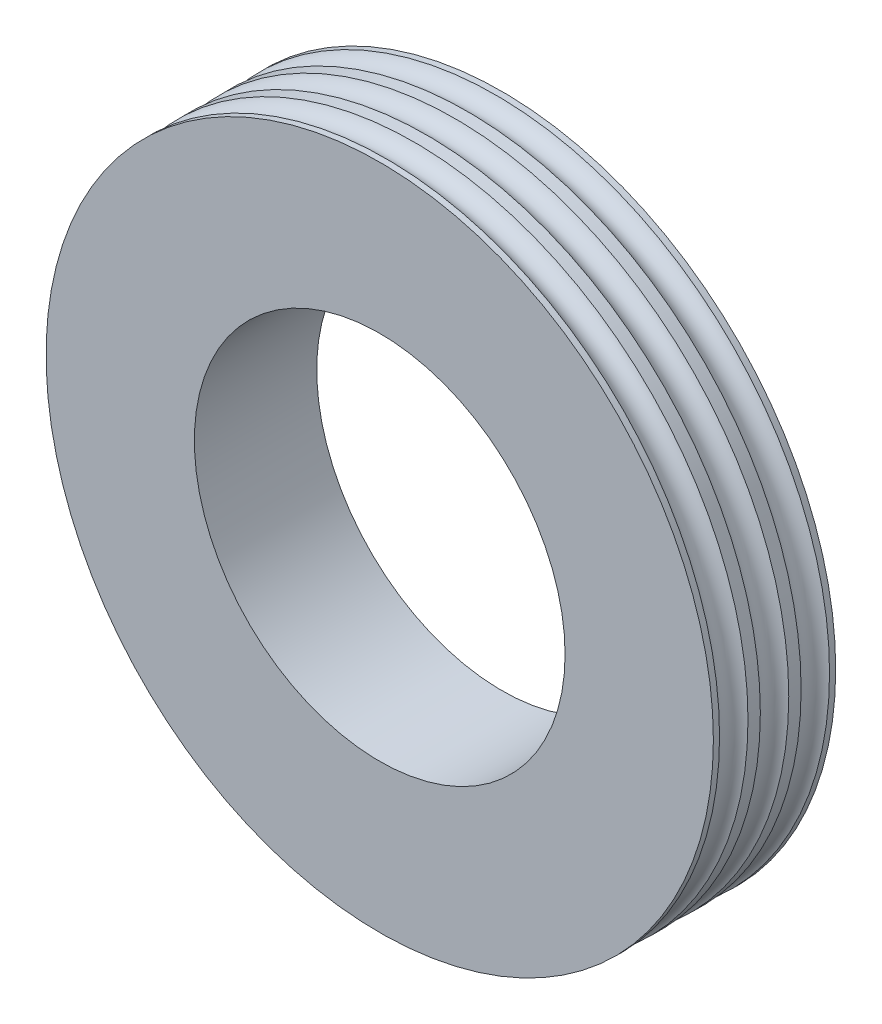
ISO-10303-21;
HEADER;
FILE_DESCRIPTION(('STEP AP214'),'2;1');
FILE_NAME('part.step','',(''),(''),'','','');
FILE_SCHEMA(('AUTOMOTIVE_DESIGN { 1 0 10303 214 1 1 1 1 }'));
ENDSEC;
DATA;
#1=APPLICATION_CONTEXT('core data for automotive mechanical design processes');
#2=APPLICATION_PROTOCOL_DEFINITION('international standard','automotive_design',2000,#1);
#3=PRODUCT_CONTEXT('',#1,'mechanical');
#4=PRODUCT('Part','Part','',(#3));
#5=PRODUCT_RELATED_PRODUCT_CATEGORY('part','',(#4));
#6=PRODUCT_DEFINITION_FORMATION('','',#4);
#7=PRODUCT_DEFINITION_CONTEXT('part definition',#1,'design');
#8=PRODUCT_DEFINITION('design','',#6,#7);
#9=PRODUCT_DEFINITION_SHAPE('','',#8);
#10=(LENGTH_UNIT() NAMED_UNIT(*) SI_UNIT(.MILLI.,.METRE.));
#11=(NAMED_UNIT(*) PLANE_ANGLE_UNIT() SI_UNIT($,.RADIAN.));
#12=(NAMED_UNIT(*) SI_UNIT($,.STERADIAN.) SOLID_ANGLE_UNIT());
#13=UNCERTAINTY_MEASURE_WITH_UNIT(LENGTH_MEASURE(1.E-05),#10,'distance_accuracy_value','');
#14=(GEOMETRIC_REPRESENTATION_CONTEXT(3) GLOBAL_UNCERTAINTY_ASSIGNED_CONTEXT((#13)) GLOBAL_UNIT_ASSIGNED_CONTEXT((#10,
#11,#12)) REPRESENTATION_CONTEXT('',''));
#15=CARTESIAN_POINT('',(0.,0.,0.));
#16=DIRECTION('',(0.,0.,1.));
#17=DIRECTION('',(1.,0.,0.));
#18=AXIS2_PLACEMENT_3D('',#15,#16,#17);
#19=CARTESIAN_POINT('',(0.,0.,3.0146773668033));
#20=DIRECTION('',(0.,0.,1.));
#21=DIRECTION('',(1.,0.,0.));
#22=AXIS2_PLACEMENT_3D('',#19,#20,#21);
#23=CYLINDRICAL_SURFACE('',#22,5.4);
#24=CARTESIAN_POINT('',(0.,0.,0.44));
#25=DIRECTION('',(0.,0.,1.));
#26=DIRECTION('',(1.,0.,0.));
#27=AXIS2_PLACEMENT_3D('',#24,#25,#26);
#28=CIRCLE('',#27,5.4);
#29=CARTESIAN_POINT('',(5.4,0.,0.44));
#30=VERTEX_POINT('',#29);
#31=EDGE_CURVE('E10',#30,#30,#28,.T.);
#32=ORIENTED_EDGE('',*,*,#31,.F.);
#33=EDGE_LOOP('',(#32));
#34=FACE_BOUND('',#33,.T.);
#35=CARTESIAN_POINT('',(0.,0.,0.24));
#36=DIRECTION('',(0.,0.,1.));
#37=DIRECTION('',(1.,0.,0.));
#38=AXIS2_PLACEMENT_3D('',#35,#36,#37);
#39=CIRCLE('',#38,5.4);
#40=CARTESIAN_POINT('',(5.4,0.,0.24));
#41=VERTEX_POINT('',#40);
#42=EDGE_CURVE('E49',#41,#41,#39,.T.);
#43=ORIENTED_EDGE('',*,*,#42,.T.);
#44=EDGE_LOOP('',(#43));
#45=FACE_BOUND('',#44,.T.);
#46=ADVANCED_FACE('F37',(#34,#45),#23,.T.);
#47=CARTESIAN_POINT('',(0.,0.,0.67));
#48=DIRECTION('',(0.,0.,1.));
#49=DIRECTION('',(1.,0.,0.));
#50=AXIS2_PLACEMENT_3D('',#47,#48,#49);
#51=TOROIDAL_SURFACE('',#50,5.5,0.250798724079689);
#52=CARTESIAN_POINT('',(0.,0.,0.9));
#53=DIRECTION('',(0.,0.,1.));
#54=DIRECTION('',(1.,0.,0.));
#55=AXIS2_PLACEMENT_3D('',#52,#53,#54);
#56=CIRCLE('',#55,5.4);
#57=CARTESIAN_POINT('',(5.4,0.,0.9));
#58=VERTEX_POINT('',#57);
#59=EDGE_CURVE('E44',#58,#58,#56,.T.);
#60=ORIENTED_EDGE('',*,*,#59,.F.);
#61=EDGE_LOOP('',(#60));
#62=FACE_BOUND('',#61,.T.);
#63=ORIENTED_EDGE('',*,*,#31,.T.);
#64=EDGE_LOOP('',(#63));
#65=FACE_BOUND('',#64,.T.);
#66=ADVANCED_FACE('F104',(#62,#65),#51,.F.);
#67=CARTESIAN_POINT('',(0.,0.,3.0146773668033));
#68=DIRECTION('',(0.,0.,1.));
#69=DIRECTION('',(1.,0.,0.));
#70=AXIS2_PLACEMENT_3D('',#67,#68,#69);
#71=CYLINDRICAL_SURFACE('',#70,5.4);
#72=ORIENTED_EDGE('',*,*,#59,.T.);
#73=EDGE_LOOP('',(#72));
#74=FACE_BOUND('',#73,.T.);
#75=CARTESIAN_POINT('',(0.,0.,1.1));
#76=DIRECTION('',(0.,0.,1.));
#77=DIRECTION('',(1.,0.,0.));
#78=AXIS2_PLACEMENT_3D('',#75,#76,#77);
#79=CIRCLE('',#78,5.4);
#80=CARTESIAN_POINT('',(5.4,0.,1.1));
#81=VERTEX_POINT('',#80);
#82=EDGE_CURVE('E72',#81,#81,#79,.T.);
#83=ORIENTED_EDGE('',*,*,#82,.F.);
#84=EDGE_LOOP('',(#83));
#85=FACE_BOUND('',#84,.T.);
#86=ADVANCED_FACE('F109',(#74,#85),#71,.T.);
#87=CARTESIAN_POINT('',(0.,0.,3.0146773668033));
#88=DIRECTION('',(0.,0.,1.));
#89=DIRECTION('',(1.,0.,0.));
#90=AXIS2_PLACEMENT_3D('',#87,#88,#89);
#91=CYLINDRICAL_SURFACE('',#90,3.);
#92=CARTESIAN_POINT('',(0.,0.,-0.32));
#93=DIRECTION('',(0.,0.,1.));
#94=DIRECTION('',(1.,0.,0.));
#95=AXIS2_PLACEMENT_3D('',#92,#93,#94);
#96=CIRCLE('',#95,3.);
#97=CARTESIAN_POINT('',(3.,0.,-0.32));
#98=VERTEX_POINT('',#97);
#99=EDGE_CURVE('E64',#98,#98,#96,.T.);
#100=ORIENTED_EDGE('',*,*,#99,.F.);
#101=EDGE_LOOP('',(#100));
#102=FACE_BOUND('',#101,.T.);
#103=CARTESIAN_POINT('',(0.,0.,1.66));
#104=DIRECTION('',(0.,0.,1.));
#105=DIRECTION('',(1.,0.,0.));
#106=AXIS2_PLACEMENT_3D('',#103,#104,#105);
#107=CIRCLE('',#106,3.);
#108=CARTESIAN_POINT('',(3.,0.,1.66));
#109=VERTEX_POINT('',#108);
#110=EDGE_CURVE('E76',#109,#109,#107,.T.);
#111=ORIENTED_EDGE('',*,*,#110,.T.);
#112=EDGE_LOOP('',(#111));
#113=FACE_BOUND('',#112,.T.);
#114=ADVANCED_FACE('F116',(#102,#113),#91,.F.);
#115=CARTESIAN_POINT('',(0.,0.,0.00999999999999981));
#116=DIRECTION('',(0.,0.,-1.));
#117=DIRECTION('',(1.,0.,0.));
#118=AXIS2_PLACEMENT_3D('',#115,#116,#117);
#119=TOROIDAL_SURFACE('',#118,5.5,0.250798724079689);
#120=CARTESIAN_POINT('',(0.,0.,-0.22));
#121=DIRECTION('',(0.,0.,1.));
#122=DIRECTION('',(1.,0.,0.));
#123=AXIS2_PLACEMENT_3D('',#120,#121,#122);
#124=CIRCLE('',#123,5.4);
#125=CARTESIAN_POINT('',(5.4,0.,-0.22));
#126=VERTEX_POINT('',#125);
#127=EDGE_CURVE('E54',#126,#126,#124,.T.);
#128=ORIENTED_EDGE('',*,*,#127,.T.);
#129=EDGE_LOOP('',(#128));
#130=FACE_BOUND('',#129,.T.);
#131=ORIENTED_EDGE('',*,*,#42,.F.);
#132=EDGE_LOOP('',(#131));
#133=FACE_BOUND('',#132,.T.);
#134=ADVANCED_FACE('F114',(#130,#133),#119,.F.);
#135=CARTESIAN_POINT('',(0.,0.,-2.3346773668033));
#136=DIRECTION('',(0.,0.,-1.));
#137=DIRECTION('',(1.,0.,0.));
#138=AXIS2_PLACEMENT_3D('',#135,#136,#137);
#139=CYLINDRICAL_SURFACE('',#138,5.4);
#140=CARTESIAN_POINT('',(0.,0.,-0.32));
#141=DIRECTION('',(0.,0.,1.));
#142=DIRECTION('',(1.,0.,0.));
#143=AXIS2_PLACEMENT_3D('',#140,#141,#142);
#144=CIRCLE('',#143,5.4);
#145=CARTESIAN_POINT('',(5.4,0.,-0.32));
#146=VERTEX_POINT('',#145);
#147=EDGE_CURVE('E60',#146,#146,#144,.T.);
#148=ORIENTED_EDGE('',*,*,#147,.T.);
#149=EDGE_LOOP('',(#148));
#150=FACE_BOUND('',#149,.T.);
#151=ORIENTED_EDGE('',*,*,#127,.F.);
#152=EDGE_LOOP('',(#151));
#153=FACE_BOUND('',#152,.T.);
#154=ADVANCED_FACE('F100',(#150,#153),#139,.T.);
#155=CARTESIAN_POINT('',(0.,5.4,-0.32));
#156=DIRECTION('',(0.,0.,1.));
#157=DIRECTION('',(-1.,0.,0.));
#158=AXIS2_PLACEMENT_3D('',#155,#156,#157);
#159=PLANE('',#158);
#160=ORIENTED_EDGE('',*,*,#99,.T.);
#161=EDGE_LOOP('',(#160));
#162=FACE_BOUND('',#161,.T.);
#163=ORIENTED_EDGE('',*,*,#147,.F.);
#164=EDGE_LOOP('',(#163));
#165=FACE_BOUND('',#164,.T.);
#166=ADVANCED_FACE('F91',(#162,#165),#159,.F.);
#167=CARTESIAN_POINT('',(0.,0.,-1.0146773668033));
#168=DIRECTION('',(0.,0.,-1.));
#169=DIRECTION('',(1.,0.,0.));
#170=AXIS2_PLACEMENT_3D('',#167,#168,#169);
#171=CYLINDRICAL_SURFACE('',#170,5.4);
#172=CARTESIAN_POINT('',(0.,0.,1.56));
#173=DIRECTION('',(0.,0.,1.));
#174=DIRECTION('',(1.,0.,0.));
#175=AXIS2_PLACEMENT_3D('',#172,#173,#174);
#176=CIRCLE('',#175,5.4);
#177=CARTESIAN_POINT('',(5.4,0.,1.56));
#178=VERTEX_POINT('',#177);
#179=EDGE_CURVE('E68',#178,#178,#176,.T.);
#180=ORIENTED_EDGE('',*,*,#179,.T.);
#181=EDGE_LOOP('',(#180));
#182=FACE_BOUND('',#181,.T.);
#183=CARTESIAN_POINT('',(0.,0.,1.66));
#184=DIRECTION('',(0.,0.,1.));
#185=DIRECTION('',(1.,0.,0.));
#186=AXIS2_PLACEMENT_3D('',#183,#184,#185);
#187=CIRCLE('',#186,5.4);
#188=CARTESIAN_POINT('',(5.4,0.,1.66));
#189=VERTEX_POINT('',#188);
#190=EDGE_CURVE('E80',#189,#189,#187,.T.);
#191=ORIENTED_EDGE('',*,*,#190,.F.);
#192=EDGE_LOOP('',(#191));
#193=FACE_BOUND('',#192,.T.);
#194=ADVANCED_FACE('F88',(#182,#193),#171,.T.);
#195=CARTESIAN_POINT('',(0.,0.,1.33));
#196=DIRECTION('',(0.,0.,-1.));
#197=DIRECTION('',(1.,0.,0.));
#198=AXIS2_PLACEMENT_3D('',#195,#196,#197);
#199=TOROIDAL_SURFACE('',#198,5.5,0.250798724079689);
#200=ORIENTED_EDGE('',*,*,#82,.T.);
#201=EDGE_LOOP('',(#200));
#202=FACE_BOUND('',#201,.T.);
#203=ORIENTED_EDGE('',*,*,#179,.F.);
#204=EDGE_LOOP('',(#203));
#205=FACE_BOUND('',#204,.T.);
#206=ADVANCED_FACE('F90',(#202,#205),#199,.F.);
#207=CARTESIAN_POINT('',(0.,3.,1.66));
#208=DIRECTION('',(0.,0.,-1.));
#209=DIRECTION('',(1.,0.,0.));
#210=AXIS2_PLACEMENT_3D('',#207,#208,#209);
#211=PLANE('',#210);
#212=ORIENTED_EDGE('',*,*,#190,.T.);
#213=EDGE_LOOP('',(#212));
#214=FACE_BOUND('',#213,.T.);
#215=ORIENTED_EDGE('',*,*,#110,.F.);
#216=EDGE_LOOP('',(#215));
#217=FACE_BOUND('',#216,.T.);
#218=ADVANCED_FACE('F85',(#214,#217),#211,.F.);
#219=CLOSED_SHELL('',(#46,#66,#86,#114,#134,#154,#166,#194,#206,#218));
#220=MANIFOLD_SOLID_BREP('B2',#219);
#221=ADVANCED_BREP_SHAPE_REPRESENTATION('',(#18,#220),#14);
#222=SHAPE_DEFINITION_REPRESENTATION(#9,#221);
ENDSEC;
END-ISO-10303-21;
